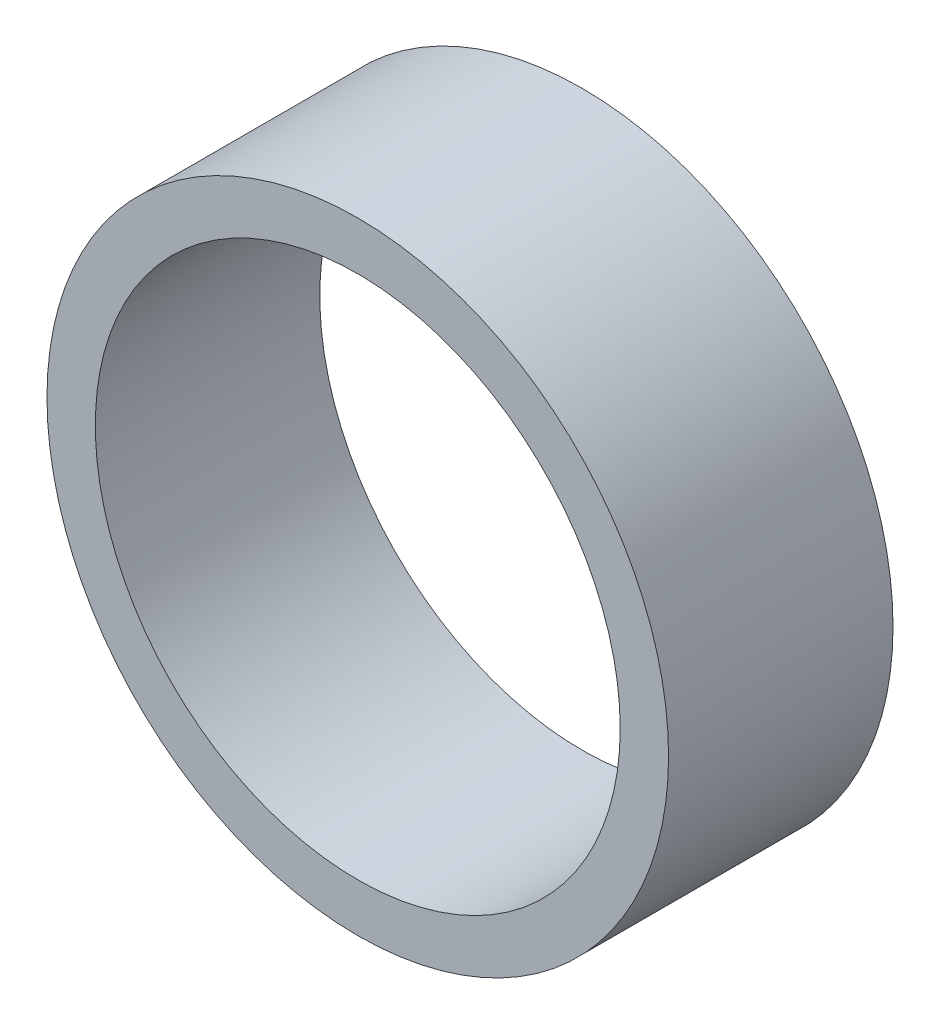
ISO-10303-21;
HEADER;
FILE_DESCRIPTION(('STEP AP214'),'2;1');
FILE_NAME('part.step','',(''),(''),'','','');
FILE_SCHEMA(('AUTOMOTIVE_DESIGN { 1 0 10303 214 1 1 1 1 }'));
ENDSEC;
DATA;
#1=APPLICATION_CONTEXT('core data for automotive mechanical design processes');
#2=APPLICATION_PROTOCOL_DEFINITION('international standard','automotive_design',2000,#1);
#3=PRODUCT_CONTEXT('',#1,'mechanical');
#4=PRODUCT('Part','Part','',(#3));
#5=PRODUCT_RELATED_PRODUCT_CATEGORY('part','',(#4));
#6=PRODUCT_DEFINITION_FORMATION('','',#4);
#7=PRODUCT_DEFINITION_CONTEXT('part definition',#1,'design');
#8=PRODUCT_DEFINITION('design','',#6,#7);
#9=PRODUCT_DEFINITION_SHAPE('','',#8);
#10=(LENGTH_UNIT() NAMED_UNIT(*) SI_UNIT(.MILLI.,.METRE.));
#11=(NAMED_UNIT(*) PLANE_ANGLE_UNIT() SI_UNIT($,.RADIAN.));
#12=(NAMED_UNIT(*) SI_UNIT($,.STERADIAN.) SOLID_ANGLE_UNIT());
#13=UNCERTAINTY_MEASURE_WITH_UNIT(LENGTH_MEASURE(1.E-05),#10,'distance_accuracy_value','');
#14=(GEOMETRIC_REPRESENTATION_CONTEXT(3) GLOBAL_UNCERTAINTY_ASSIGNED_CONTEXT((#13)) GLOBAL_UNIT_ASSIGNED_CONTEXT((#10,
#11,#12)) REPRESENTATION_CONTEXT('',''));
#15=CARTESIAN_POINT('',(0.,0.,0.));
#16=DIRECTION('',(0.,0.,1.));
#17=DIRECTION('',(1.,0.,0.));
#18=AXIS2_PLACEMENT_3D('',#15,#16,#17);
#19=CARTESIAN_POINT('',(0.,0.,6.5));
#20=DIRECTION('',(0.,0.,1.));
#21=DIRECTION('',(1.,0.,0.));
#22=AXIS2_PLACEMENT_3D('',#19,#20,#21);
#23=PLANE('',#22);
#24=CARTESIAN_POINT('',(0.,0.,6.5));
#25=DIRECTION('',(0.,0.,1.));
#26=DIRECTION('',(1.,0.,0.));
#27=AXIS2_PLACEMENT_3D('',#24,#25,#26);
#28=CIRCLE('',#27,9.);
#29=CARTESIAN_POINT('',(9.,0.,6.5));
#30=VERTEX_POINT('',#29);
#31=EDGE_CURVE('E10',#30,#30,#28,.T.);
#32=ORIENTED_EDGE('',*,*,#31,.T.);
#33=EDGE_LOOP('',(#32));
#34=FACE_BOUND('',#33,.T.);
#35=CARTESIAN_POINT('',(0.,0.,6.5));
#36=DIRECTION('',(0.,0.,1.));
#37=DIRECTION('',(1.,0.,0.));
#38=AXIS2_PLACEMENT_3D('',#35,#36,#37);
#39=CIRCLE('',#38,7.6);
#40=CARTESIAN_POINT('',(7.6,0.,6.5));
#41=VERTEX_POINT('',#40);
#42=EDGE_CURVE('E41',#41,#41,#39,.T.);
#43=ORIENTED_EDGE('',*,*,#42,.F.);
#44=EDGE_LOOP('',(#43));
#45=FACE_BOUND('',#44,.T.);
#46=ADVANCED_FACE('F30',(#34,#45),#23,.T.);
#47=CARTESIAN_POINT('',(0.,0.,0.));
#48=DIRECTION('',(0.,0.,1.));
#49=DIRECTION('',(1.,0.,0.));
#50=AXIS2_PLACEMENT_3D('',#47,#48,#49);
#51=PLANE('',#50);
#52=CARTESIAN_POINT('',(0.,0.,0.));
#53=DIRECTION('',(0.,0.,1.));
#54=DIRECTION('',(1.,0.,0.));
#55=AXIS2_PLACEMENT_3D('',#52,#53,#54);
#56=CIRCLE('',#55,9.);
#57=CARTESIAN_POINT('',(9.,0.,0.));
#58=VERTEX_POINT('',#57);
#59=EDGE_CURVE('E34',#58,#58,#56,.T.);
#60=ORIENTED_EDGE('',*,*,#59,.F.);
#61=EDGE_LOOP('',(#60));
#62=FACE_BOUND('',#61,.T.);
#63=CARTESIAN_POINT('',(0.,0.,0.));
#64=DIRECTION('',(0.,0.,1.));
#65=DIRECTION('',(1.,0.,0.));
#66=AXIS2_PLACEMENT_3D('',#63,#64,#65);
#67=CIRCLE('',#66,7.6);
#68=CARTESIAN_POINT('',(7.6,0.,0.));
#69=VERTEX_POINT('',#68);
#70=EDGE_CURVE('E43',#69,#69,#67,.T.);
#71=ORIENTED_EDGE('',*,*,#70,.T.);
#72=EDGE_LOOP('',(#71));
#73=FACE_BOUND('',#72,.T.);
#74=ADVANCED_FACE('F53',(#62,#73),#51,.F.);
#75=CARTESIAN_POINT('',(0.,0.,6.5));
#76=DIRECTION('',(0.,0.,-1.));
#77=DIRECTION('',(-1.,0.,0.));
#78=AXIS2_PLACEMENT_3D('',#75,#76,#77);
#79=CYLINDRICAL_SURFACE('',#78,9.);
#80=ORIENTED_EDGE('',*,*,#31,.F.);
#81=EDGE_LOOP('',(#80));
#82=FACE_BOUND('',#81,.T.);
#83=ORIENTED_EDGE('',*,*,#59,.T.);
#84=EDGE_LOOP('',(#83));
#85=FACE_BOUND('',#84,.T.);
#86=ADVANCED_FACE('F32',(#82,#85),#79,.T.);
#87=CARTESIAN_POINT('',(0.,0.,6.5));
#88=DIRECTION('',(0.,0.,-1.));
#89=DIRECTION('',(-1.,0.,0.));
#90=AXIS2_PLACEMENT_3D('',#87,#88,#89);
#91=CYLINDRICAL_SURFACE('',#90,7.6);
#92=ORIENTED_EDGE('',*,*,#42,.T.);
#93=EDGE_LOOP('',(#92));
#94=FACE_BOUND('',#93,.T.);
#95=ORIENTED_EDGE('',*,*,#70,.F.);
#96=EDGE_LOOP('',(#95));
#97=FACE_BOUND('',#96,.T.);
#98=ADVANCED_FACE('F49',(#94,#97),#91,.F.);
#99=CLOSED_SHELL('',(#46,#74,#86,#98));
#100=MANIFOLD_SOLID_BREP('B2',#99);
#101=ADVANCED_BREP_SHAPE_REPRESENTATION('',(#18,#100),#14);
#102=SHAPE_DEFINITION_REPRESENTATION(#9,#101);
ENDSEC;
END-ISO-10303-21;
